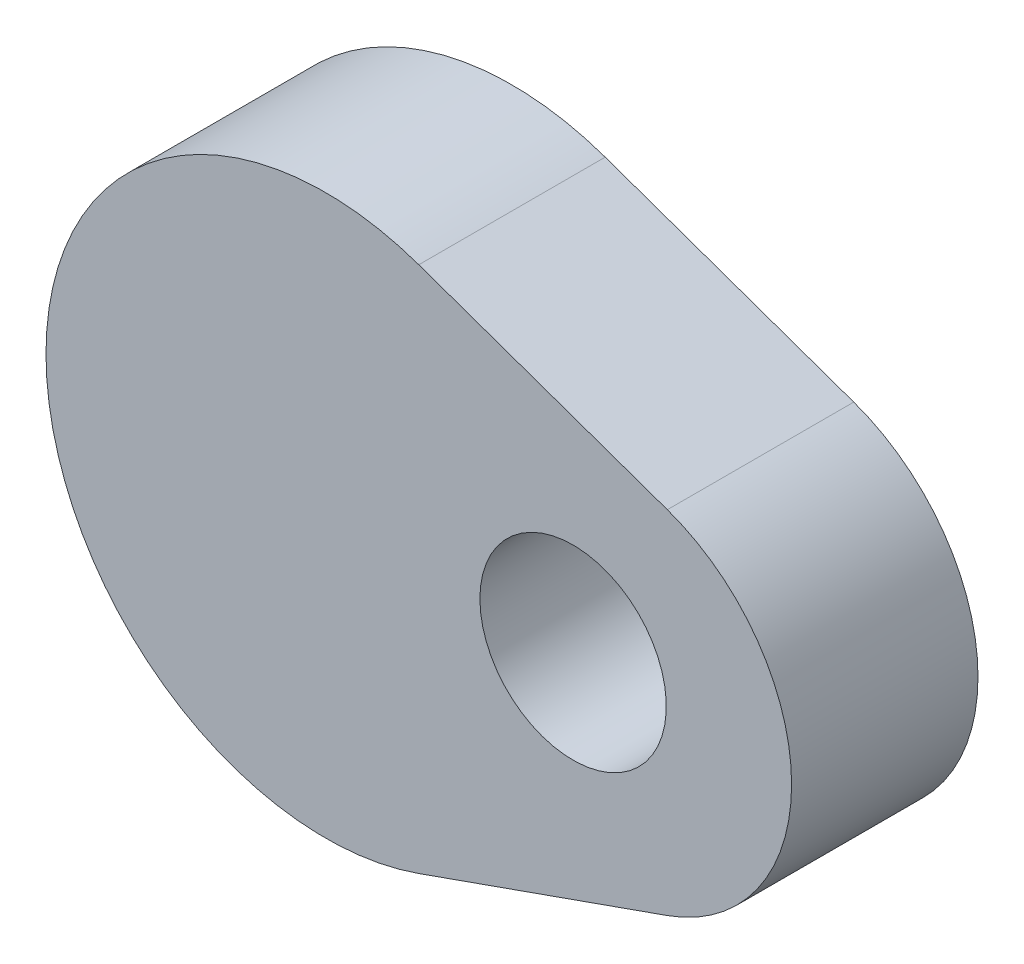
ISO-10303-21;
HEADER;
FILE_DESCRIPTION(('STEP AP214'),'2;1');
FILE_NAME('part.step','',(''),(''),'','','');
FILE_SCHEMA(('AUTOMOTIVE_DESIGN { 1 0 10303 214 1 1 1 1 }'));
ENDSEC;
DATA;
#1=APPLICATION_CONTEXT('core data for automotive mechanical design processes');
#2=APPLICATION_PROTOCOL_DEFINITION('international standard','automotive_design',2000,#1);
#3=PRODUCT_CONTEXT('',#1,'mechanical');
#4=PRODUCT('Part','Part','',(#3));
#5=PRODUCT_RELATED_PRODUCT_CATEGORY('part','',(#4));
#6=PRODUCT_DEFINITION_FORMATION('','',#4);
#7=PRODUCT_DEFINITION_CONTEXT('part definition',#1,'design');
#8=PRODUCT_DEFINITION('design','',#6,#7);
#9=PRODUCT_DEFINITION_SHAPE('','',#8);
#10=(LENGTH_UNIT() NAMED_UNIT(*) SI_UNIT(.MILLI.,.METRE.));
#11=(NAMED_UNIT(*) PLANE_ANGLE_UNIT() SI_UNIT($,.RADIAN.));
#12=(NAMED_UNIT(*) SI_UNIT($,.STERADIAN.) SOLID_ANGLE_UNIT());
#13=UNCERTAINTY_MEASURE_WITH_UNIT(LENGTH_MEASURE(1.E-05),#10,'distance_accuracy_value','');
#14=(GEOMETRIC_REPRESENTATION_CONTEXT(3) GLOBAL_UNCERTAINTY_ASSIGNED_CONTEXT((#13)) GLOBAL_UNIT_ASSIGNED_CONTEXT((#10,
#11,#12)) REPRESENTATION_CONTEXT('',''));
#15=CARTESIAN_POINT('',(0.,0.,0.));
#16=DIRECTION('',(0.,0.,1.));
#17=DIRECTION('',(1.,0.,0.));
#18=AXIS2_PLACEMENT_3D('',#15,#16,#17);
#19=CARTESIAN_POINT('',(0.,0.,10.));
#20=DIRECTION('',(0.,0.,-1.));
#21=DIRECTION('',(-1.,0.,0.));
#22=AXIS2_PLACEMENT_3D('',#19,#20,#21);
#23=CYLINDRICAL_SURFACE('',#22,15.);
#24=CARTESIAN_POINT('',(0.,0.,0.));
#25=DIRECTION('',(0.,0.,1.));
#26=DIRECTION('',(1.,0.,0.));
#27=AXIS2_PLACEMENT_3D('',#24,#25,#26);
#28=CIRCLE('',#27,15.);
#29=CARTESIAN_POINT('',(5.,14.142135623731,0.));
#30=VERTEX_POINT('',#29);
#31=CARTESIAN_POINT('',(5.,-14.142135623731,0.));
#32=VERTEX_POINT('',#31);
#33=EDGE_CURVE('E98',#30,#32,#28,.T.);
#34=ORIENTED_EDGE('',*,*,#33,.T.);
#35=DIRECTION('',(0.,0.,-1.));
#36=VECTOR('',#35,1.);
#37=CARTESIAN_POINT('',(5.,-14.142135623731,10.));
#38=LINE('',#37,#36);
#39=CARTESIAN_POINT('',(5.,-14.142135623731,10.));
#40=VERTEX_POINT('',#39);
#41=EDGE_CURVE('E11',#40,#32,#38,.T.);
#42=ORIENTED_EDGE('',*,*,#41,.F.);
#43=CARTESIAN_POINT('',(0.,0.,10.));
#44=DIRECTION('',(0.,0.,1.));
#45=DIRECTION('',(1.,0.,0.));
#46=AXIS2_PLACEMENT_3D('',#43,#44,#45);
#47=CIRCLE('',#46,15.);
#48=CARTESIAN_POINT('',(5.,14.142135623731,10.));
#49=VERTEX_POINT('',#48);
#50=EDGE_CURVE('E86',#49,#40,#47,.T.);
#51=ORIENTED_EDGE('',*,*,#50,.F.);
#52=DIRECTION('',(0.,0.,-1.));
#53=VECTOR('',#52,1.);
#54=CARTESIAN_POINT('',(5.,14.142135623731,10.));
#55=LINE('',#54,#53);
#56=EDGE_CURVE('E94',#49,#30,#55,.T.);
#57=ORIENTED_EDGE('',*,*,#56,.T.);
#58=EDGE_LOOP('',(#34,#42,#51,#57));
#59=FACE_BOUND('',#58,.T.);
#60=ADVANCED_FACE('F35',(#59),#23,.T.);
#61=CARTESIAN_POINT('',(18.3333333333333,-9.42809041582064,10.));
#62=DIRECTION('',(-0.333333333333333,0.942809041582063,0.));
#63=DIRECTION('',(-0.942809041582063,-0.333333333333333,0.));
#64=AXIS2_PLACEMENT_3D('',#61,#62,#63);
#65=PLANE('',#64);
#66=DIRECTION('',(0.942809041582063,0.333333333333333,0.));
#67=VECTOR('',#66,1.);
#68=CARTESIAN_POINT('',(18.3333333333333,-9.42809041582064,0.));
#69=LINE('',#68,#67);
#70=CARTESIAN_POINT('',(18.3333333333333,-9.42809041582064,0.));
#71=VERTEX_POINT('',#70);
#72=EDGE_CURVE('E90',#32,#71,#69,.T.);
#73=ORIENTED_EDGE('',*,*,#72,.T.);
#74=DIRECTION('',(0.,0.,-1.));
#75=VECTOR('',#74,1.);
#76=CARTESIAN_POINT('',(18.3333333333333,-9.42809041582064,10.));
#77=LINE('',#76,#75);
#78=CARTESIAN_POINT('',(18.3333333333333,-9.42809041582064,10.));
#79=VERTEX_POINT('',#78);
#80=EDGE_CURVE('E43',#79,#71,#77,.T.);
#81=ORIENTED_EDGE('',*,*,#80,.F.);
#82=DIRECTION('',(0.942809041582063,0.333333333333333,0.));
#83=VECTOR('',#82,1.);
#84=CARTESIAN_POINT('',(18.3333333333333,-9.42809041582064,10.));
#85=LINE('',#84,#83);
#86=EDGE_CURVE('E81',#40,#79,#85,.T.);
#87=ORIENTED_EDGE('',*,*,#86,.F.);
#88=ORIENTED_EDGE('',*,*,#41,.T.);
#89=EDGE_LOOP('',(#73,#81,#87,#88));
#90=FACE_BOUND('',#89,.T.);
#91=ADVANCED_FACE('F89',(#90),#65,.F.);
#92=CARTESIAN_POINT('',(15.,0.,10.));
#93=DIRECTION('',(0.,0.,-1.));
#94=DIRECTION('',(-1.,0.,0.));
#95=AXIS2_PLACEMENT_3D('',#92,#93,#94);
#96=CYLINDRICAL_SURFACE('',#95,10.);
#97=CARTESIAN_POINT('',(15.,0.,0.));
#98=DIRECTION('',(0.,0.,1.));
#99=DIRECTION('',(-1.,0.,0.));
#100=AXIS2_PLACEMENT_3D('',#97,#98,#99);
#101=CIRCLE('',#100,10.);
#102=CARTESIAN_POINT('',(18.3333333333333,9.42809041582064,0.));
#103=VERTEX_POINT('',#102);
#104=EDGE_CURVE('E68',#71,#103,#101,.T.);
#105=ORIENTED_EDGE('',*,*,#104,.T.);
#106=DIRECTION('',(0.,0.,-1.));
#107=VECTOR('',#106,1.);
#108=CARTESIAN_POINT('',(18.3333333333333,9.42809041582064,10.));
#109=LINE('',#108,#107);
#110=CARTESIAN_POINT('',(18.3333333333333,9.42809041582064,10.));
#111=VERTEX_POINT('',#110);
#112=EDGE_CURVE('E91',#111,#103,#109,.T.);
#113=ORIENTED_EDGE('',*,*,#112,.F.);
#114=CARTESIAN_POINT('',(15.,0.,10.));
#115=DIRECTION('',(0.,0.,1.));
#116=DIRECTION('',(-1.,0.,0.));
#117=AXIS2_PLACEMENT_3D('',#114,#115,#116);
#118=CIRCLE('',#117,10.);
#119=EDGE_CURVE('E84',#79,#111,#118,.T.);
#120=ORIENTED_EDGE('',*,*,#119,.F.);
#121=ORIENTED_EDGE('',*,*,#80,.T.);
#122=EDGE_LOOP('',(#105,#113,#120,#121));
#123=FACE_BOUND('',#122,.T.);
#124=ADVANCED_FACE('F92',(#123),#96,.T.);
#125=CARTESIAN_POINT('',(5.,14.142135623731,10.));
#126=DIRECTION('',(-0.333333333333333,-0.942809041582063,0.));
#127=DIRECTION('',(0.942809041582063,-0.333333333333333,0.));
#128=AXIS2_PLACEMENT_3D('',#125,#126,#127);
#129=PLANE('',#128);
#130=DIRECTION('',(-0.942809041582063,0.333333333333333,0.));
#131=VECTOR('',#130,1.);
#132=CARTESIAN_POINT('',(5.,14.142135623731,0.));
#133=LINE('',#132,#131);
#134=EDGE_CURVE('E74',#103,#30,#133,.T.);
#135=ORIENTED_EDGE('',*,*,#134,.T.);
#136=ORIENTED_EDGE('',*,*,#56,.F.);
#137=DIRECTION('',(-0.942809041582063,0.333333333333333,0.));
#138=VECTOR('',#137,1.);
#139=CARTESIAN_POINT('',(5.,14.142135623731,10.));
#140=LINE('',#139,#138);
#141=EDGE_CURVE('E51',#111,#49,#140,.T.);
#142=ORIENTED_EDGE('',*,*,#141,.F.);
#143=ORIENTED_EDGE('',*,*,#112,.T.);
#144=EDGE_LOOP('',(#135,#136,#142,#143));
#145=FACE_BOUND('',#144,.T.);
#146=ADVANCED_FACE('F106',(#145),#129,.F.);
#147=CARTESIAN_POINT('',(0.,0.,10.));
#148=DIRECTION('',(0.,0.,1.));
#149=DIRECTION('',(1.,0.,0.));
#150=AXIS2_PLACEMENT_3D('',#147,#148,#149);
#151=PLANE('',#150);
#152=CARTESIAN_POINT('',(13.2772624017069,0.262881408578457,10.));
#153=DIRECTION('',(0.,0.,-1.));
#154=DIRECTION('',(-1.,0.,0.));
#155=AXIS2_PLACEMENT_3D('',#152,#153,#154);
#156=CIRCLE('',#155,5.);
#157=CARTESIAN_POINT('',(8.27726240170685,0.262881408578457,10.));
#158=VERTEX_POINT('',#157);
#159=EDGE_CURVE('E101',#158,#158,#156,.T.);
#160=ORIENTED_EDGE('',*,*,#159,.T.);
#161=EDGE_LOOP('',(#160));
#162=FACE_BOUND('',#161,.T.);
#163=ORIENTED_EDGE('',*,*,#50,.T.);
#164=ORIENTED_EDGE('',*,*,#86,.T.);
#165=ORIENTED_EDGE('',*,*,#119,.T.);
#166=ORIENTED_EDGE('',*,*,#141,.T.);
#167=EDGE_LOOP('',(#163,#164,#165,#166));
#168=FACE_BOUND('',#167,.T.);
#169=ADVANCED_FACE('F82',(#162,#168),#151,.T.);
#170=CARTESIAN_POINT('',(0.,0.,0.));
#171=DIRECTION('',(0.,0.,1.));
#172=DIRECTION('',(1.,0.,0.));
#173=AXIS2_PLACEMENT_3D('',#170,#171,#172);
#174=PLANE('',#173);
#175=CARTESIAN_POINT('',(13.2772624017069,0.262881408578457,0.));
#176=DIRECTION('',(0.,0.,-1.));
#177=DIRECTION('',(-1.,0.,0.));
#178=AXIS2_PLACEMENT_3D('',#175,#176,#177);
#179=CIRCLE('',#178,5.);
#180=CARTESIAN_POINT('',(8.27726240170685,0.262881408578457,0.));
#181=VERTEX_POINT('',#180);
#182=EDGE_CURVE('E112',#181,#181,#179,.T.);
#183=ORIENTED_EDGE('',*,*,#182,.F.);
#184=EDGE_LOOP('',(#183));
#185=FACE_BOUND('',#184,.T.);
#186=ORIENTED_EDGE('',*,*,#33,.F.);
#187=ORIENTED_EDGE('',*,*,#134,.F.);
#188=ORIENTED_EDGE('',*,*,#104,.F.);
#189=ORIENTED_EDGE('',*,*,#72,.F.);
#190=EDGE_LOOP('',(#186,#187,#188,#189));
#191=FACE_BOUND('',#190,.T.);
#192=ADVANCED_FACE('F109',(#185,#191),#174,.F.);
#193=CARTESIAN_POINT('',(13.2772624017069,0.262881408578457,10.));
#194=DIRECTION('',(0.,0.,-1.));
#195=DIRECTION('',(-1.,0.,0.));
#196=AXIS2_PLACEMENT_3D('',#193,#194,#195);
#197=CYLINDRICAL_SURFACE('',#196,5.);
#198=ORIENTED_EDGE('',*,*,#159,.F.);
#199=EDGE_LOOP('',(#198));
#200=FACE_BOUND('',#199,.T.);
#201=ORIENTED_EDGE('',*,*,#182,.T.);
#202=EDGE_LOOP('',(#201));
#203=FACE_BOUND('',#202,.T.);
#204=ADVANCED_FACE('F119',(#200,#203),#197,.F.);
#205=CLOSED_SHELL('',(#60,#91,#124,#146,#169,#192,#204));
#206=MANIFOLD_SOLID_BREP('B2',#205);
#207=ADVANCED_BREP_SHAPE_REPRESENTATION('',(#18,#206),#14);
#208=SHAPE_DEFINITION_REPRESENTATION(#9,#207);
ENDSEC;
END-ISO-10303-21;
